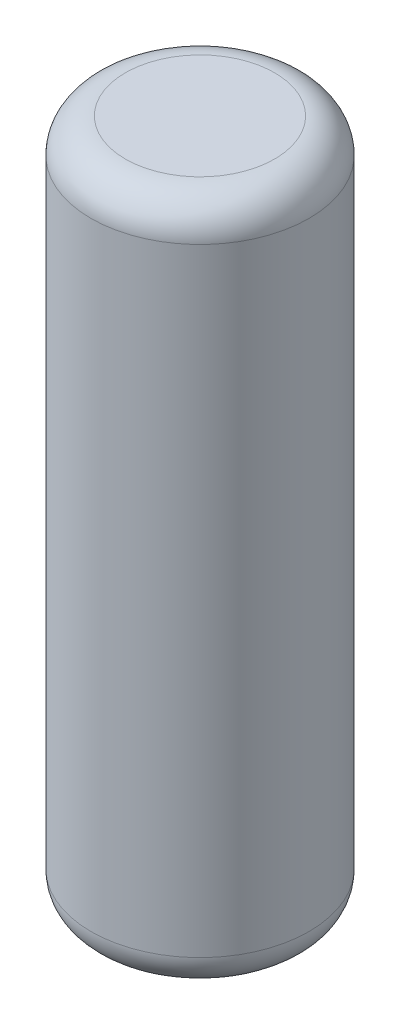
ISO-10303-21;
HEADER;
FILE_DESCRIPTION(('STEP AP214'),'2;1');
FILE_NAME('part.step','',(''),(''),'','','');
FILE_SCHEMA(('AUTOMOTIVE_DESIGN { 1 0 10303 214 1 1 1 1 }'));
ENDSEC;
DATA;
#1=APPLICATION_CONTEXT('core data for automotive mechanical design processes');
#2=APPLICATION_PROTOCOL_DEFINITION('international standard','automotive_design',2000,#1);
#3=PRODUCT_CONTEXT('',#1,'mechanical');
#4=PRODUCT('Part','Part','',(#3));
#5=PRODUCT_RELATED_PRODUCT_CATEGORY('part','',(#4));
#6=PRODUCT_DEFINITION_FORMATION('','',#4);
#7=PRODUCT_DEFINITION_CONTEXT('part definition',#1,'design');
#8=PRODUCT_DEFINITION('design','',#6,#7);
#9=PRODUCT_DEFINITION_SHAPE('','',#8);
#10=(LENGTH_UNIT() NAMED_UNIT(*) SI_UNIT(.MILLI.,.METRE.));
#11=(NAMED_UNIT(*) PLANE_ANGLE_UNIT() SI_UNIT($,.RADIAN.));
#12=(NAMED_UNIT(*) SI_UNIT($,.STERADIAN.) SOLID_ANGLE_UNIT());
#13=UNCERTAINTY_MEASURE_WITH_UNIT(LENGTH_MEASURE(1.E-05),#10,'distance_accuracy_value','');
#14=(GEOMETRIC_REPRESENTATION_CONTEXT(3) GLOBAL_UNCERTAINTY_ASSIGNED_CONTEXT((#13)) GLOBAL_UNIT_ASSIGNED_CONTEXT((#10,
#11,#12)) REPRESENTATION_CONTEXT('',''));
#15=CARTESIAN_POINT('',(0.,0.,0.));
#16=DIRECTION('',(0.,0.,1.));
#17=DIRECTION('',(1.,0.,0.));
#18=AXIS2_PLACEMENT_3D('',#15,#16,#17);
#19=CARTESIAN_POINT('',(0.,5.,0.));
#20=DIRECTION('',(0.,-1.,0.));
#21=DIRECTION('',(0.,0.,-1.));
#22=AXIS2_PLACEMENT_3D('',#19,#20,#21);
#23=CYLINDRICAL_SURFACE('',#22,1.58877);
#24=CARTESIAN_POINT('',(0.,-4.5,0.));
#25=DIRECTION('',(0.,1.,0.));
#26=DIRECTION('',(0.,0.,1.));
#27=AXIS2_PLACEMENT_3D('',#24,#25,#26);
#28=CIRCLE('',#27,1.58877);
#29=CARTESIAN_POINT('',(0.,-4.5,1.58877));
#30=VERTEX_POINT('',#29);
#31=EDGE_CURVE('E39',#30,#30,#28,.T.);
#32=ORIENTED_EDGE('',*,*,#31,.T.);
#33=EDGE_LOOP('',(#32));
#34=FACE_BOUND('',#33,.T.);
#35=CARTESIAN_POINT('',(0.,4.5,0.));
#36=DIRECTION('',(0.,1.,0.));
#37=DIRECTION('',(0.,0.,1.));
#38=AXIS2_PLACEMENT_3D('',#35,#36,#37);
#39=CIRCLE('',#38,1.58877);
#40=CARTESIAN_POINT('',(0.,4.5,1.58877));
#41=VERTEX_POINT('',#40);
#42=EDGE_CURVE('E43',#41,#41,#39,.F.);
#43=ORIENTED_EDGE('',*,*,#42,.T.);
#44=EDGE_LOOP('',(#43));
#45=FACE_BOUND('',#44,.T.);
#46=ADVANCED_FACE('F28',(#34,#45),#23,.T.);
#47=CARTESIAN_POINT('',(0.,5.,0.));
#48=DIRECTION('',(0.,1.,0.));
#49=DIRECTION('',(0.,0.,1.));
#50=AXIS2_PLACEMENT_3D('',#47,#48,#49);
#51=PLANE('',#50);
#52=CARTESIAN_POINT('',(0.,5.,0.));
#53=DIRECTION('',(0.,1.,0.));
#54=DIRECTION('',(0.,0.,1.));
#55=AXIS2_PLACEMENT_3D('',#52,#53,#54);
#56=CIRCLE('',#55,1.08877);
#57=CARTESIAN_POINT('',(0.,5.,1.08877));
#58=VERTEX_POINT('',#57);
#59=EDGE_CURVE('E10',#58,#58,#56,.T.);
#60=ORIENTED_EDGE('',*,*,#59,.T.);
#61=EDGE_LOOP('',(#60));
#62=FACE_BOUND('',#61,.T.);
#63=ADVANCED_FACE('F59',(#62),#51,.T.);
#64=CARTESIAN_POINT('',(0.,-5.,0.));
#65=DIRECTION('',(0.,1.,0.));
#66=DIRECTION('',(0.,0.,1.));
#67=AXIS2_PLACEMENT_3D('',#64,#65,#66);
#68=PLANE('',#67);
#69=CARTESIAN_POINT('',(0.,-5.,0.));
#70=DIRECTION('',(0.,1.,0.));
#71=DIRECTION('',(0.,0.,1.));
#72=AXIS2_PLACEMENT_3D('',#69,#70,#71);
#73=CIRCLE('',#72,1.08877);
#74=CARTESIAN_POINT('',(0.,-5.,1.08877));
#75=VERTEX_POINT('',#74);
#76=EDGE_CURVE('E35',#75,#75,#73,.F.);
#77=ORIENTED_EDGE('',*,*,#76,.T.);
#78=EDGE_LOOP('',(#77));
#79=FACE_BOUND('',#78,.T.);
#80=ADVANCED_FACE('F56',(#79),#68,.F.);
#81=CARTESIAN_POINT('',(0.,-4.5,0.));
#82=DIRECTION('',(0.,1.,0.));
#83=DIRECTION('',(0.,0.,1.));
#84=AXIS2_PLACEMENT_3D('',#81,#82,#83);
#85=TOROIDAL_SURFACE('',#84,1.08877,0.5);
#86=ORIENTED_EDGE('',*,*,#76,.F.);
#87=EDGE_LOOP('',(#86));
#88=FACE_BOUND('',#87,.T.);
#89=ORIENTED_EDGE('',*,*,#31,.F.);
#90=EDGE_LOOP('',(#89));
#91=FACE_BOUND('',#90,.T.);
#92=ADVANCED_FACE('F52',(#88,#91),#85,.T.);
#93=CARTESIAN_POINT('',(0.,4.5,0.));
#94=DIRECTION('',(0.,1.,0.));
#95=DIRECTION('',(0.,0.,1.));
#96=AXIS2_PLACEMENT_3D('',#93,#94,#95);
#97=TOROIDAL_SURFACE('',#96,1.08877,0.5);
#98=ORIENTED_EDGE('',*,*,#42,.F.);
#99=EDGE_LOOP('',(#98));
#100=FACE_BOUND('',#99,.T.);
#101=ORIENTED_EDGE('',*,*,#59,.F.);
#102=EDGE_LOOP('',(#101));
#103=FACE_BOUND('',#102,.T.);
#104=ADVANCED_FACE('F30',(#100,#103),#97,.T.);
#105=CLOSED_SHELL('',(#46,#63,#80,#92,#104));
#106=MANIFOLD_SOLID_BREP('B2',#105);
#107=ADVANCED_BREP_SHAPE_REPRESENTATION('',(#18,#106),#14);
#108=SHAPE_DEFINITION_REPRESENTATION(#9,#107);
ENDSEC;
END-ISO-10303-21;
